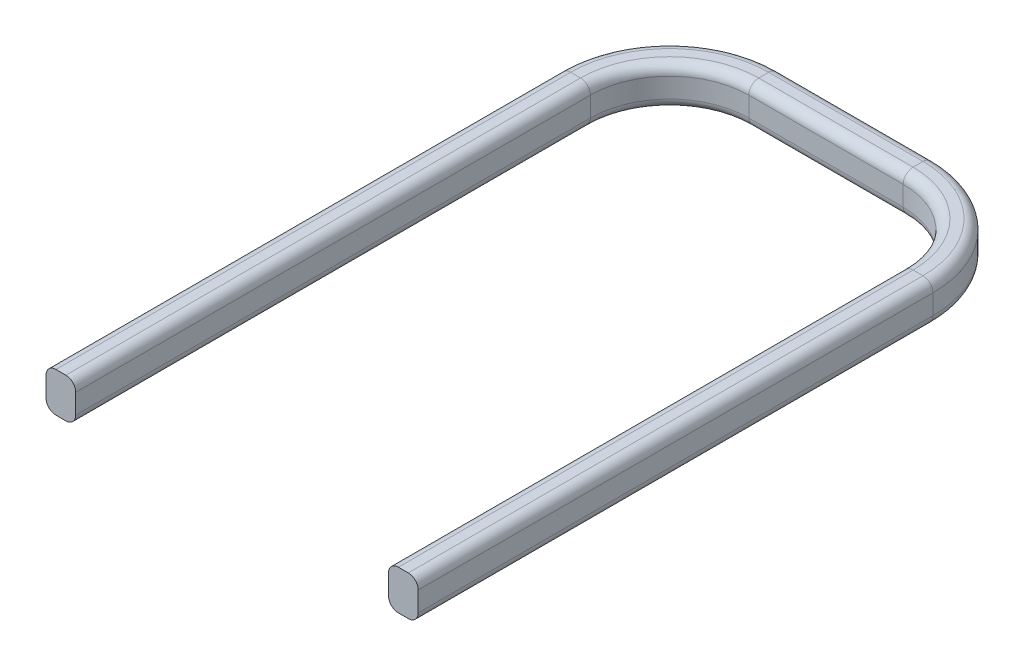
ISO-10303-21;
HEADER;
FILE_DESCRIPTION(('STEP AP214'),'2;1');
FILE_NAME('part.step','',(''),(''),'','','');
FILE_SCHEMA(('AUTOMOTIVE_DESIGN { 1 0 10303 214 1 1 1 1 }'));
ENDSEC;
DATA;
#1=APPLICATION_CONTEXT('core data for automotive mechanical design processes');
#2=APPLICATION_PROTOCOL_DEFINITION('international standard','automotive_design',2000,#1);
#3=PRODUCT_CONTEXT('',#1,'mechanical');
#4=PRODUCT('Part','Part','',(#3));
#5=PRODUCT_RELATED_PRODUCT_CATEGORY('part','',(#4));
#6=PRODUCT_DEFINITION_FORMATION('','',#4);
#7=PRODUCT_DEFINITION_CONTEXT('part definition',#1,'design');
#8=PRODUCT_DEFINITION('design','',#6,#7);
#9=PRODUCT_DEFINITION_SHAPE('','',#8);
#10=(LENGTH_UNIT() NAMED_UNIT(*) SI_UNIT(.MILLI.,.METRE.));
#11=(NAMED_UNIT(*) PLANE_ANGLE_UNIT() SI_UNIT($,.RADIAN.));
#12=(NAMED_UNIT(*) SI_UNIT($,.STERADIAN.) SOLID_ANGLE_UNIT());
#13=UNCERTAINTY_MEASURE_WITH_UNIT(LENGTH_MEASURE(1.E-05),#10,'distance_accuracy_value','');
#14=(GEOMETRIC_REPRESENTATION_CONTEXT(3) GLOBAL_UNCERTAINTY_ASSIGNED_CONTEXT((#13)) GLOBAL_UNIT_ASSIGNED_CONTEXT((#10,
#11,#12)) REPRESENTATION_CONTEXT('',''));
#15=CARTESIAN_POINT('',(0.,0.,0.));
#16=DIRECTION('',(0.,0.,1.));
#17=DIRECTION('',(1.,0.,0.));
#18=AXIS2_PLACEMENT_3D('',#15,#16,#17);
#19=CARTESIAN_POINT('',(0.,-4.5,81.2586733435107));
#20=DIRECTION('',(0.,0.,1.));
#21=DIRECTION('',(1.,0.,0.));
#22=AXIS2_PLACEMENT_3D('',#19,#20,#21);
#23=PLANE('',#22);
#24=DIRECTION('',(0.,-1.,0.));
#25=VECTOR('',#24,1.);
#26=CARTESIAN_POINT('',(-47.,-4.5,81.2586733435107));
#27=LINE('',#26,#25);
#28=CARTESIAN_POINT('',(-47.,3.,81.2586733435107));
#29=VERTEX_POINT('',#28);
#30=CARTESIAN_POINT('',(-47.,-2.,81.2586733435107));
#31=VERTEX_POINT('',#30);
#32=EDGE_CURVE('E391',#29,#31,#27,.T.);
#33=ORIENTED_EDGE('',*,*,#32,.T.);
#34=CARTESIAN_POINT('',(-44.5,-2.,81.2586733435107));
#35=DIRECTION('',(0.,0.,1.));
#36=DIRECTION('',(1.,0.,0.));
#37=AXIS2_PLACEMENT_3D('',#34,#35,#36);
#38=CIRCLE('',#37,2.5);
#39=CARTESIAN_POINT('',(-44.5,-4.5,81.2586733435107));
#40=VERTEX_POINT('',#39);
#41=EDGE_CURVE('E316',#31,#40,#38,.T.);
#42=ORIENTED_EDGE('',*,*,#41,.T.);
#43=DIRECTION('',(1.,0.,0.));
#44=VECTOR('',#43,1.);
#45=CARTESIAN_POINT('',(-39.5,-4.5,81.2586733435107));
#46=LINE('',#45,#44);
#47=CARTESIAN_POINT('',(-42.,-4.5,81.2586733435107));
#48=VERTEX_POINT('',#47);
#49=EDGE_CURVE('E396',#40,#48,#46,.T.);
#50=ORIENTED_EDGE('',*,*,#49,.T.);
#51=CARTESIAN_POINT('',(-42.,-2.,81.2586733435107));
#52=DIRECTION('',(0.,0.,1.));
#53=DIRECTION('',(1.,0.,0.));
#54=AXIS2_PLACEMENT_3D('',#51,#52,#53);
#55=CIRCLE('',#54,2.5);
#56=CARTESIAN_POINT('',(-39.5,-2.,81.2586733435107));
#57=VERTEX_POINT('',#56);
#58=EDGE_CURVE('E314',#48,#57,#55,.T.);
#59=ORIENTED_EDGE('',*,*,#58,.T.);
#60=DIRECTION('',(0.,1.,0.));
#61=VECTOR('',#60,1.);
#62=CARTESIAN_POINT('',(-39.5,-4.5,81.2586733435107));
#63=LINE('',#62,#61);
#64=CARTESIAN_POINT('',(-39.5,3.,81.2586733435107));
#65=VERTEX_POINT('',#64);
#66=EDGE_CURVE('E335',#57,#65,#63,.T.);
#67=ORIENTED_EDGE('',*,*,#66,.T.);
#68=CARTESIAN_POINT('',(-42.,3.,81.2586733435107));
#69=DIRECTION('',(0.,0.,1.));
#70=DIRECTION('',(1.,0.,0.));
#71=AXIS2_PLACEMENT_3D('',#68,#69,#70);
#72=CIRCLE('',#71,2.5);
#73=CARTESIAN_POINT('',(-42.,5.5,81.2586733435107));
#74=VERTEX_POINT('',#73);
#75=EDGE_CURVE('E62',#65,#74,#72,.T.);
#76=ORIENTED_EDGE('',*,*,#75,.T.);
#77=DIRECTION('',(-1.,0.,0.));
#78=VECTOR('',#77,1.);
#79=CARTESIAN_POINT('',(-39.5,5.5,81.2586733435107));
#80=LINE('',#79,#78);
#81=CARTESIAN_POINT('',(-44.5,5.5,81.2586733435107));
#82=VERTEX_POINT('',#81);
#83=EDGE_CURVE('E389',#74,#82,#80,.T.);
#84=ORIENTED_EDGE('',*,*,#83,.T.);
#85=CARTESIAN_POINT('',(-44.5,3.,81.2586733435107));
#86=DIRECTION('',(0.,0.,1.));
#87=DIRECTION('',(1.,0.,0.));
#88=AXIS2_PLACEMENT_3D('',#85,#86,#87);
#89=CIRCLE('',#88,2.5);
#90=EDGE_CURVE('E312',#82,#29,#89,.T.);
#91=ORIENTED_EDGE('',*,*,#90,.T.);
#92=EDGE_LOOP('',(#33,#42,#50,#59,#67,#76,#84,#91));
#93=FACE_BOUND('',#92,.T.);
#94=ADVANCED_FACE('F40',(#93),#23,.T.);
#95=CARTESIAN_POINT('',(0.,-4.5,81.2586733435107));
#96=DIRECTION('',(0.,0.,-1.));
#97=DIRECTION('',(-1.,0.,0.));
#98=AXIS2_PLACEMENT_3D('',#95,#96,#97);
#99=PLANE('',#98);
#100=DIRECTION('',(-1.,0.,0.));
#101=VECTOR('',#100,1.);
#102=CARTESIAN_POINT('',(39.5,-4.5,81.2586733435107));
#103=LINE('',#102,#101);
#104=CARTESIAN_POINT('',(44.5,-4.5,81.2586733435107));
#105=VERTEX_POINT('',#104);
#106=CARTESIAN_POINT('',(42.,-4.5,81.2586733435107));
#107=VERTEX_POINT('',#106);
#108=EDGE_CURVE('E220',#105,#107,#103,.T.);
#109=ORIENTED_EDGE('',*,*,#108,.F.);
#110=CARTESIAN_POINT('',(44.5,-2.,81.2586733435107));
#111=DIRECTION('',(0.,0.,-1.));
#112=DIRECTION('',(-1.,0.,0.));
#113=AXIS2_PLACEMENT_3D('',#110,#111,#112);
#114=CIRCLE('',#113,2.5);
#115=CARTESIAN_POINT('',(47.,-2.,81.2586733435107));
#116=VERTEX_POINT('',#115);
#117=EDGE_CURVE('E203',#105,#116,#114,.F.);
#118=ORIENTED_EDGE('',*,*,#117,.T.);
#119=DIRECTION('',(0.,-1.,0.));
#120=VECTOR('',#119,1.);
#121=CARTESIAN_POINT('',(47.,-4.5,81.2586733435107));
#122=LINE('',#121,#120);
#123=CARTESIAN_POINT('',(47.,3.,81.2586733435107));
#124=VERTEX_POINT('',#123);
#125=EDGE_CURVE('E230',#124,#116,#122,.T.);
#126=ORIENTED_EDGE('',*,*,#125,.F.);
#127=CARTESIAN_POINT('',(44.5,3.,81.2586733435107));
#128=DIRECTION('',(0.,0.,-1.));
#129=DIRECTION('',(-1.,0.,0.));
#130=AXIS2_PLACEMENT_3D('',#127,#128,#129);
#131=CIRCLE('',#130,2.5);
#132=CARTESIAN_POINT('',(44.5,5.5,81.2586733435107));
#133=VERTEX_POINT('',#132);
#134=EDGE_CURVE('E239',#124,#133,#131,.F.);
#135=ORIENTED_EDGE('',*,*,#134,.T.);
#136=DIRECTION('',(1.,0.,0.));
#137=VECTOR('',#136,1.);
#138=CARTESIAN_POINT('',(39.5,5.5,81.2586733435107));
#139=LINE('',#138,#137);
#140=CARTESIAN_POINT('',(42.,5.5,81.2586733435107));
#141=VERTEX_POINT('',#140);
#142=EDGE_CURVE('E233',#141,#133,#139,.T.);
#143=ORIENTED_EDGE('',*,*,#142,.F.);
#144=CARTESIAN_POINT('',(42.,3.,81.2586733435107));
#145=DIRECTION('',(0.,0.,-1.));
#146=DIRECTION('',(-1.,0.,0.));
#147=AXIS2_PLACEMENT_3D('',#144,#145,#146);
#148=CIRCLE('',#147,2.5);
#149=CARTESIAN_POINT('',(39.5,3.,81.2586733435107));
#150=VERTEX_POINT('',#149);
#151=EDGE_CURVE('E225',#141,#150,#148,.F.);
#152=ORIENTED_EDGE('',*,*,#151,.T.);
#153=DIRECTION('',(0.,1.,0.));
#154=VECTOR('',#153,1.);
#155=CARTESIAN_POINT('',(39.5,-4.5,81.2586733435107));
#156=LINE('',#155,#154);
#157=CARTESIAN_POINT('',(39.5,-2.,81.2586733435107));
#158=VERTEX_POINT('',#157);
#159=EDGE_CURVE('E412',#158,#150,#156,.T.);
#160=ORIENTED_EDGE('',*,*,#159,.F.);
#161=CARTESIAN_POINT('',(42.,-2.,81.2586733435107));
#162=DIRECTION('',(0.,0.,-1.));
#163=DIRECTION('',(-1.,0.,0.));
#164=AXIS2_PLACEMENT_3D('',#161,#162,#163);
#165=CIRCLE('',#164,2.5);
#166=EDGE_CURVE('E214',#158,#107,#165,.F.);
#167=ORIENTED_EDGE('',*,*,#166,.T.);
#168=EDGE_LOOP('',(#109,#118,#126,#135,#143,#152,#160,#167));
#169=FACE_BOUND('',#168,.T.);
#170=ADVANCED_FACE('F228',(#169),#99,.F.);
#171=CARTESIAN_POINT('',(-39.5,-4.5,81.2586733435107));
#172=DIRECTION('',(-1.,0.,0.));
#173=DIRECTION('',(0.,0.,1.));
#174=AXIS2_PLACEMENT_3D('',#171,#172,#173);
#175=PLANE('',#174);
#176=ORIENTED_EDGE('',*,*,#66,.F.);
#177=DIRECTION('',(0.,0.,-1.));
#178=VECTOR('',#177,1.);
#179=CARTESIAN_POINT('',(-39.5,-2.,81.2586733435107));
#180=LINE('',#179,#178);
#181=CARTESIAN_POINT('',(-39.5,-2.,-48.7413266564892));
#182=VERTEX_POINT('',#181);
#183=EDGE_CURVE('E320',#57,#182,#180,.T.);
#184=ORIENTED_EDGE('',*,*,#183,.T.);
#185=DIRECTION('',(0.,1.,0.));
#186=VECTOR('',#185,1.);
#187=CARTESIAN_POINT('',(-39.5,-4.5,-48.7413266564892));
#188=LINE('',#187,#186);
#189=CARTESIAN_POINT('',(-39.5,3.,-48.7413266564892));
#190=VERTEX_POINT('',#189);
#191=EDGE_CURVE('E385',#182,#190,#188,.T.);
#192=ORIENTED_EDGE('',*,*,#191,.T.);
#193=DIRECTION('',(0.,0.,-1.));
#194=VECTOR('',#193,1.);
#195=CARTESIAN_POINT('',(-39.5,3.,81.2586733435107));
#196=LINE('',#195,#194);
#197=EDGE_CURVE('E318',#190,#65,#196,.F.);
#198=ORIENTED_EDGE('',*,*,#197,.T.);
#199=EDGE_LOOP('',(#176,#184,#192,#198));
#200=FACE_BOUND('',#199,.T.);
#201=ADVANCED_FACE('F382',(#200),#175,.F.);
#202=CARTESIAN_POINT('',(-39.5,5.5,81.2586733435107));
#203=DIRECTION('',(0.,-1.,0.));
#204=DIRECTION('',(0.,0.,-1.));
#205=AXIS2_PLACEMENT_3D('',#202,#203,#204);
#206=PLANE('',#205);
#207=DIRECTION('',(-1.,0.,0.));
#208=VECTOR('',#207,1.);
#209=CARTESIAN_POINT('',(-39.5,5.5,-48.7413266564892));
#210=LINE('',#209,#208);
#211=CARTESIAN_POINT('',(-42.,5.5,-48.7413266564892));
#212=VERTEX_POINT('',#211);
#213=CARTESIAN_POINT('',(-44.5,5.5,-48.7413266564892));
#214=VERTEX_POINT('',#213);
#215=EDGE_CURVE('E395',#212,#214,#210,.T.);
#216=ORIENTED_EDGE('',*,*,#215,.T.);
#217=DIRECTION('',(0.,0.,-1.));
#218=VECTOR('',#217,1.);
#219=CARTESIAN_POINT('',(-44.5,5.5,81.2586733435107));
#220=LINE('',#219,#218);
#221=EDGE_CURVE('E11',#214,#82,#220,.F.);
#222=ORIENTED_EDGE('',*,*,#221,.T.);
#223=ORIENTED_EDGE('',*,*,#83,.F.);
#224=DIRECTION('',(0.,0.,-1.));
#225=VECTOR('',#224,1.);
#226=CARTESIAN_POINT('',(-42.,5.5,81.2586733435107));
#227=LINE('',#226,#225);
#228=EDGE_CURVE('E49',#74,#212,#227,.T.);
#229=ORIENTED_EDGE('',*,*,#228,.T.);
#230=EDGE_LOOP('',(#216,#222,#223,#229));
#231=FACE_BOUND('',#230,.T.);
#232=ADVANCED_FACE('F811',(#231),#206,.F.);
#233=CARTESIAN_POINT('',(-47.,-4.5,81.2586733435107));
#234=DIRECTION('',(1.,0.,0.));
#235=DIRECTION('',(0.,0.,-1.));
#236=AXIS2_PLACEMENT_3D('',#233,#234,#235);
#237=PLANE('',#236);
#238=DIRECTION('',(0.,-1.,0.));
#239=VECTOR('',#238,1.);
#240=CARTESIAN_POINT('',(-47.,-4.5,-48.7413266564892));
#241=LINE('',#240,#239);
#242=CARTESIAN_POINT('',(-47.,3.,-48.7413266564892));
#243=VERTEX_POINT('',#242);
#244=CARTESIAN_POINT('',(-47.,-2.,-48.7413266564892));
#245=VERTEX_POINT('',#244);
#246=EDGE_CURVE('E416',#243,#245,#241,.T.);
#247=ORIENTED_EDGE('',*,*,#246,.T.);
#248=DIRECTION('',(0.,0.,-1.));
#249=VECTOR('',#248,1.);
#250=CARTESIAN_POINT('',(-47.,-2.,81.2586733435107));
#251=LINE('',#250,#249);
#252=EDGE_CURVE('E309',#245,#31,#251,.F.);
#253=ORIENTED_EDGE('',*,*,#252,.T.);
#254=ORIENTED_EDGE('',*,*,#32,.F.);
#255=DIRECTION('',(0.,0.,-1.));
#256=VECTOR('',#255,1.);
#257=CARTESIAN_POINT('',(-47.,3.,81.2586733435107));
#258=LINE('',#257,#256);
#259=EDGE_CURVE('E307',#29,#243,#258,.T.);
#260=ORIENTED_EDGE('',*,*,#259,.T.);
#261=EDGE_LOOP('',(#247,#253,#254,#260));
#262=FACE_BOUND('',#261,.T.);
#263=ADVANCED_FACE('F800',(#262),#237,.F.);
#264=CARTESIAN_POINT('',(-39.5,-4.5,81.2586733435107));
#265=DIRECTION('',(0.,1.,0.));
#266=DIRECTION('',(-1.,0.,0.));
#267=AXIS2_PLACEMENT_3D('',#264,#265,#266);
#268=PLANE('',#267);
#269=ORIENTED_EDGE('',*,*,#49,.F.);
#270=DIRECTION('',(0.,0.,-1.));
#271=VECTOR('',#270,1.);
#272=CARTESIAN_POINT('',(-44.5,-4.5,81.2586733435107));
#273=LINE('',#272,#271);
#274=CARTESIAN_POINT('',(-44.5,-4.5,-48.7413266564892));
#275=VERTEX_POINT('',#274);
#276=EDGE_CURVE('E305',#40,#275,#273,.T.);
#277=ORIENTED_EDGE('',*,*,#276,.T.);
#278=DIRECTION('',(1.,0.,0.));
#279=VECTOR('',#278,1.);
#280=CARTESIAN_POINT('',(-39.5,-4.5,-48.7413266564892));
#281=LINE('',#280,#279);
#282=CARTESIAN_POINT('',(-42.,-4.5,-48.7413266564892));
#283=VERTEX_POINT('',#282);
#284=EDGE_CURVE('E401',#275,#283,#281,.T.);
#285=ORIENTED_EDGE('',*,*,#284,.T.);
#286=DIRECTION('',(0.,0.,-1.));
#287=VECTOR('',#286,1.);
#288=CARTESIAN_POINT('',(-42.,-4.5,81.2586733435107));
#289=LINE('',#288,#287);
#290=EDGE_CURVE('E303',#283,#48,#289,.F.);
#291=ORIENTED_EDGE('',*,*,#290,.T.);
#292=EDGE_LOOP('',(#269,#277,#285,#291));
#293=FACE_BOUND('',#292,.T.);
#294=ADVANCED_FACE('F789',(#293),#268,.F.);
#295=CARTESIAN_POINT('',(-19.5,-4.5,-48.7413266564893));
#296=DIRECTION('',(0.,-1.,0.));
#297=DIRECTION('',(0.,0.,-1.));
#298=AXIS2_PLACEMENT_3D('',#295,#296,#297);
#299=CYLINDRICAL_SURFACE('',#298,20.);
#300=ORIENTED_EDGE('',*,*,#191,.F.);
#301=CARTESIAN_POINT('',(-19.5,-2.,-48.7413266564893));
#302=DIRECTION('',(0.,1.,0.));
#303=DIRECTION('',(0.,0.,1.));
#304=AXIS2_PLACEMENT_3D('',#301,#302,#303);
#305=CIRCLE('',#304,20.);
#306=CARTESIAN_POINT('',(-19.5,-2.,-68.7413266564893));
#307=VERTEX_POINT('',#306);
#308=EDGE_CURVE('E284',#182,#307,#305,.F.);
#309=ORIENTED_EDGE('',*,*,#308,.T.);
#310=DIRECTION('',(0.,1.,0.));
#311=VECTOR('',#310,1.);
#312=CARTESIAN_POINT('',(-19.5,-4.5,-68.7413266564893));
#313=LINE('',#312,#311);
#314=CARTESIAN_POINT('',(-19.5,3.,-68.7413266564893));
#315=VERTEX_POINT('',#314);
#316=EDGE_CURVE('E397',#307,#315,#313,.T.);
#317=ORIENTED_EDGE('',*,*,#316,.T.);
#318=CARTESIAN_POINT('',(-19.5,3.,-48.7413266564893));
#319=DIRECTION('',(0.,-1.,0.));
#320=DIRECTION('',(0.,0.,-1.));
#321=AXIS2_PLACEMENT_3D('',#318,#319,#320);
#322=CIRCLE('',#321,20.);
#323=EDGE_CURVE('E282',#315,#190,#322,.F.);
#324=ORIENTED_EDGE('',*,*,#323,.T.);
#325=EDGE_LOOP('',(#300,#309,#317,#324));
#326=FACE_BOUND('',#325,.T.);
#327=ADVANCED_FACE('F778',(#326),#299,.F.);
#328=CARTESIAN_POINT('',(-39.5,5.5,-48.7413266564895));
#329=DIRECTION('',(0.,-1.,0.));
#330=DIRECTION('',(0.,0.,-1.));
#331=AXIS2_PLACEMENT_3D('',#328,#329,#330);
#332=PLANE('',#331);
#333=DIRECTION('',(0.,0.,-1.));
#334=VECTOR('',#333,1.);
#335=CARTESIAN_POINT('',(-19.5,5.5,-68.7413266564893));
#336=LINE('',#335,#334);
#337=CARTESIAN_POINT('',(-19.5,5.5,-71.2413266564893));
#338=VERTEX_POINT('',#337);
#339=CARTESIAN_POINT('',(-19.5,5.5,-73.7413266564893));
#340=VERTEX_POINT('',#339);
#341=EDGE_CURVE('E400',#338,#340,#336,.T.);
#342=ORIENTED_EDGE('',*,*,#341,.T.);
#343=CARTESIAN_POINT('',(-19.5,5.5,-48.7413266564893));
#344=DIRECTION('',(0.,-1.,0.));
#345=DIRECTION('',(0.,0.,-1.));
#346=AXIS2_PLACEMENT_3D('',#343,#344,#345);
#347=CIRCLE('',#346,25.);
#348=EDGE_CURVE('E301',#340,#214,#347,.F.);
#349=ORIENTED_EDGE('',*,*,#348,.T.);
#350=ORIENTED_EDGE('',*,*,#215,.F.);
#351=CARTESIAN_POINT('',(-19.5,5.5,-48.7413266564893));
#352=DIRECTION('',(0.,-1.,0.));
#353=DIRECTION('',(0.,0.,-1.));
#354=AXIS2_PLACEMENT_3D('',#351,#352,#353);
#355=CIRCLE('',#354,22.5);
#356=EDGE_CURVE('E299',#212,#338,#355,.T.);
#357=ORIENTED_EDGE('',*,*,#356,.T.);
#358=EDGE_LOOP('',(#342,#349,#350,#357));
#359=FACE_BOUND('',#358,.T.);
#360=ADVANCED_FACE('F767',(#359),#332,.F.);
#361=CARTESIAN_POINT('',(-19.5,-4.5,-48.7413266564893));
#362=DIRECTION('',(0.,-1.,0.));
#363=DIRECTION('',(0.,0.,-1.));
#364=AXIS2_PLACEMENT_3D('',#361,#362,#363);
#365=CYLINDRICAL_SURFACE('',#364,27.5);
#366=DIRECTION('',(0.,-1.,0.));
#367=VECTOR('',#366,1.);
#368=CARTESIAN_POINT('',(-19.5,-4.5,-76.2413266564893));
#369=LINE('',#368,#367);
#370=CARTESIAN_POINT('',(-19.5,3.,-76.2413266564893));
#371=VERTEX_POINT('',#370);
#372=CARTESIAN_POINT('',(-19.5,-2.,-76.2413266564893));
#373=VERTEX_POINT('',#372);
#374=EDGE_CURVE('E419',#371,#373,#369,.T.);
#375=ORIENTED_EDGE('',*,*,#374,.T.);
#376=CARTESIAN_POINT('',(-19.5,-2.,-48.7413266564893));
#377=DIRECTION('',(0.,1.,0.));
#378=DIRECTION('',(0.,0.,1.));
#379=AXIS2_PLACEMENT_3D('',#376,#377,#378);
#380=CIRCLE('',#379,27.5);
#381=EDGE_CURVE('E267',#373,#245,#380,.T.);
#382=ORIENTED_EDGE('',*,*,#381,.T.);
#383=ORIENTED_EDGE('',*,*,#246,.F.);
#384=CARTESIAN_POINT('',(-19.5,3.,-48.7413266564893));
#385=DIRECTION('',(0.,-1.,0.));
#386=DIRECTION('',(0.,0.,-1.));
#387=AXIS2_PLACEMENT_3D('',#384,#385,#386);
#388=CIRCLE('',#387,27.5);
#389=EDGE_CURVE('E265',#243,#371,#388,.T.);
#390=ORIENTED_EDGE('',*,*,#389,.T.);
#391=EDGE_LOOP('',(#375,#382,#383,#390));
#392=FACE_BOUND('',#391,.T.);
#393=ADVANCED_FACE('F756',(#392),#365,.T.);
#394=CARTESIAN_POINT('',(-39.5,-4.5,-48.7413266564895));
#395=DIRECTION('',(0.,1.,0.));
#396=DIRECTION('',(0.,0.,1.));
#397=AXIS2_PLACEMENT_3D('',#394,#395,#396);
#398=PLANE('',#397);
#399=ORIENTED_EDGE('',*,*,#284,.F.);
#400=CARTESIAN_POINT('',(-19.5,-4.5,-48.7413266564893));
#401=DIRECTION('',(0.,1.,0.));
#402=DIRECTION('',(0.,0.,1.));
#403=AXIS2_PLACEMENT_3D('',#400,#401,#402);
#404=CIRCLE('',#403,25.);
#405=CARTESIAN_POINT('',(-19.5,-4.5,-73.7413266564893));
#406=VERTEX_POINT('',#405);
#407=EDGE_CURVE('E263',#275,#406,#404,.F.);
#408=ORIENTED_EDGE('',*,*,#407,.T.);
#409=DIRECTION('',(0.,0.,1.));
#410=VECTOR('',#409,1.);
#411=CARTESIAN_POINT('',(-19.5,-4.5,-68.7413266564893));
#412=LINE('',#411,#410);
#413=CARTESIAN_POINT('',(-19.5,-4.5,-71.2413266564893));
#414=VERTEX_POINT('',#413);
#415=EDGE_CURVE('E406',#406,#414,#412,.T.);
#416=ORIENTED_EDGE('',*,*,#415,.T.);
#417=CARTESIAN_POINT('',(-19.5,-4.5,-48.7413266564893));
#418=DIRECTION('',(0.,1.,0.));
#419=DIRECTION('',(0.,0.,1.));
#420=AXIS2_PLACEMENT_3D('',#417,#418,#419);
#421=CIRCLE('',#420,22.5);
#422=EDGE_CURVE('E261',#414,#283,#421,.T.);
#423=ORIENTED_EDGE('',*,*,#422,.T.);
#424=EDGE_LOOP('',(#399,#408,#416,#423));
#425=FACE_BOUND('',#424,.T.);
#426=ADVANCED_FACE('F746',(#425),#398,.F.);
#427=CARTESIAN_POINT('',(-19.5,-4.5,-68.7413266564893));
#428=DIRECTION('',(0.,0.,-1.));
#429=DIRECTION('',(-1.,0.,0.));
#430=AXIS2_PLACEMENT_3D('',#427,#428,#429);
#431=PLANE('',#430);
#432=ORIENTED_EDGE('',*,*,#316,.F.);
#433=DIRECTION('',(1.,0.,0.));
#434=VECTOR('',#433,1.);
#435=CARTESIAN_POINT('',(-19.5,-2.,-68.7413266564893));
#436=LINE('',#435,#434);
#437=CARTESIAN_POINT('',(19.4999999999999,-2.,-68.7413266564893));
#438=VERTEX_POINT('',#437);
#439=EDGE_CURVE('E280',#307,#438,#436,.T.);
#440=ORIENTED_EDGE('',*,*,#439,.T.);
#441=DIRECTION('',(0.,1.,0.));
#442=VECTOR('',#441,1.);
#443=CARTESIAN_POINT('',(19.4999999999999,-4.5,-68.7413266564893));
#444=LINE('',#443,#442);
#445=CARTESIAN_POINT('',(19.4999999999999,3.,-68.7413266564893));
#446=VERTEX_POINT('',#445);
#447=EDGE_CURVE('E402',#438,#446,#444,.T.);
#448=ORIENTED_EDGE('',*,*,#447,.T.);
#449=DIRECTION('',(1.,0.,0.));
#450=VECTOR('',#449,1.);
#451=CARTESIAN_POINT('',(-19.5,3.,-68.7413266564893));
#452=LINE('',#451,#450);
#453=EDGE_CURVE('E278',#446,#315,#452,.F.);
#454=ORIENTED_EDGE('',*,*,#453,.T.);
#455=EDGE_LOOP('',(#432,#440,#448,#454));
#456=FACE_BOUND('',#455,.T.);
#457=ADVANCED_FACE('F479',(#456),#431,.F.);
#458=CARTESIAN_POINT('',(-19.5,5.5,-68.7413266564893));
#459=DIRECTION('',(0.,-1.,0.));
#460=DIRECTION('',(0.,0.,-1.));
#461=AXIS2_PLACEMENT_3D('',#458,#459,#460);
#462=PLANE('',#461);
#463=DIRECTION('',(0.,0.,-1.));
#464=VECTOR('',#463,1.);
#465=CARTESIAN_POINT('',(19.4999999999999,5.5,-68.7413266564893));
#466=LINE('',#465,#464);
#467=CARTESIAN_POINT('',(19.4999999999999,5.5,-71.2413266564893));
#468=VERTEX_POINT('',#467);
#469=CARTESIAN_POINT('',(19.4999999999999,5.5,-73.7413266564893));
#470=VERTEX_POINT('',#469);
#471=EDGE_CURVE('E405',#468,#470,#466,.T.);
#472=ORIENTED_EDGE('',*,*,#471,.T.);
#473=DIRECTION('',(1.,0.,0.));
#474=VECTOR('',#473,1.);
#475=CARTESIAN_POINT('',(-19.5,5.5,-73.7413266564893));
#476=LINE('',#475,#474);
#477=EDGE_CURVE('E297',#470,#340,#476,.F.);
#478=ORIENTED_EDGE('',*,*,#477,.T.);
#479=ORIENTED_EDGE('',*,*,#341,.F.);
#480=DIRECTION('',(1.,0.,0.));
#481=VECTOR('',#480,1.);
#482=CARTESIAN_POINT('',(-19.5,5.5,-71.2413266564893));
#483=LINE('',#482,#481);
#484=EDGE_CURVE('E295',#338,#468,#483,.T.);
#485=ORIENTED_EDGE('',*,*,#484,.T.);
#486=EDGE_LOOP('',(#472,#478,#479,#485));
#487=FACE_BOUND('',#486,.T.);
#488=ADVANCED_FACE('F484',(#487),#462,.F.);
#489=CARTESIAN_POINT('',(-19.5,-4.5,-76.2413266564893));
#490=DIRECTION('',(0.,0.,1.));
#491=DIRECTION('',(1.,0.,0.));
#492=AXIS2_PLACEMENT_3D('',#489,#490,#491);
#493=PLANE('',#492);
#494=DIRECTION('',(0.,-1.,0.));
#495=VECTOR('',#494,1.);
#496=CARTESIAN_POINT('',(19.4999999999999,-4.5,-76.2413266564893));
#497=LINE('',#496,#495);
#498=CARTESIAN_POINT('',(19.4999999999999,3.,-76.2413266564893));
#499=VERTEX_POINT('',#498);
#500=CARTESIAN_POINT('',(19.4999999999999,-2.,-76.2413266564893));
#501=VERTEX_POINT('',#500);
#502=EDGE_CURVE('E422',#499,#501,#497,.T.);
#503=ORIENTED_EDGE('',*,*,#502,.T.);
#504=DIRECTION('',(1.,0.,0.));
#505=VECTOR('',#504,1.);
#506=CARTESIAN_POINT('',(-19.5,-2.,-76.2413266564893));
#507=LINE('',#506,#505);
#508=EDGE_CURVE('E259',#501,#373,#507,.F.);
#509=ORIENTED_EDGE('',*,*,#508,.T.);
#510=ORIENTED_EDGE('',*,*,#374,.F.);
#511=DIRECTION('',(1.,0.,0.));
#512=VECTOR('',#511,1.);
#513=CARTESIAN_POINT('',(-19.5,3.,-76.2413266564893));
#514=LINE('',#513,#512);
#515=EDGE_CURVE('E257',#371,#499,#514,.T.);
#516=ORIENTED_EDGE('',*,*,#515,.T.);
#517=EDGE_LOOP('',(#503,#509,#510,#516));
#518=FACE_BOUND('',#517,.T.);
#519=ADVANCED_FACE('F718',(#518),#493,.F.);
#520=CARTESIAN_POINT('',(-19.5,-4.5,-68.7413266564893));
#521=DIRECTION('',(0.,1.,0.));
#522=DIRECTION('',(0.,0.,1.));
#523=AXIS2_PLACEMENT_3D('',#520,#521,#522);
#524=PLANE('',#523);
#525=ORIENTED_EDGE('',*,*,#415,.F.);
#526=DIRECTION('',(1.,0.,0.));
#527=VECTOR('',#526,1.);
#528=CARTESIAN_POINT('',(-19.5,-4.5,-73.7413266564893));
#529=LINE('',#528,#527);
#530=CARTESIAN_POINT('',(19.4999999999999,-4.5,-73.7413266564893));
#531=VERTEX_POINT('',#530);
#532=EDGE_CURVE('E255',#406,#531,#529,.T.);
#533=ORIENTED_EDGE('',*,*,#532,.T.);
#534=DIRECTION('',(0.,0.,1.));
#535=VECTOR('',#534,1.);
#536=CARTESIAN_POINT('',(19.4999999999999,-4.5,-68.7413266564893));
#537=LINE('',#536,#535);
#538=CARTESIAN_POINT('',(19.4999999999999,-4.5,-71.2413266564893));
#539=VERTEX_POINT('',#538);
#540=EDGE_CURVE('E411',#531,#539,#537,.T.);
#541=ORIENTED_EDGE('',*,*,#540,.T.);
#542=DIRECTION('',(1.,0.,0.));
#543=VECTOR('',#542,1.);
#544=CARTESIAN_POINT('',(-19.5,-4.5,-71.2413266564893));
#545=LINE('',#544,#543);
#546=EDGE_CURVE('E253',#539,#414,#545,.F.);
#547=ORIENTED_EDGE('',*,*,#546,.T.);
#548=EDGE_LOOP('',(#525,#533,#541,#547));
#549=FACE_BOUND('',#548,.T.);
#550=ADVANCED_FACE('F446',(#549),#524,.F.);
#551=CARTESIAN_POINT('',(19.5,-4.5,-48.7413266564893));
#552=DIRECTION('',(0.,-1.,0.));
#553=DIRECTION('',(0.,0.,-1.));
#554=AXIS2_PLACEMENT_3D('',#551,#552,#553);
#555=CYLINDRICAL_SURFACE('',#554,20.);
#556=ORIENTED_EDGE('',*,*,#447,.F.);
#557=CARTESIAN_POINT('',(19.5,-2.,-48.7413266564893));
#558=DIRECTION('',(0.,1.,0.));
#559=DIRECTION('',(0.,0.,1.));
#560=AXIS2_PLACEMENT_3D('',#557,#558,#559);
#561=CIRCLE('',#560,20.);
#562=CARTESIAN_POINT('',(39.5,-2.,-48.7413266564892));
#563=VERTEX_POINT('',#562);
#564=EDGE_CURVE('E276',#438,#563,#561,.F.);
#565=ORIENTED_EDGE('',*,*,#564,.T.);
#566=DIRECTION('',(0.,1.,0.));
#567=VECTOR('',#566,1.);
#568=CARTESIAN_POINT('',(39.5,-4.5,-48.7413266564892));
#569=LINE('',#568,#567);
#570=CARTESIAN_POINT('',(39.5,3.,-48.7413266564892));
#571=VERTEX_POINT('',#570);
#572=EDGE_CURVE('E407',#563,#571,#569,.T.);
#573=ORIENTED_EDGE('',*,*,#572,.T.);
#574=CARTESIAN_POINT('',(19.5,3.,-48.7413266564893));
#575=DIRECTION('',(0.,-1.,0.));
#576=DIRECTION('',(0.,0.,-1.));
#577=AXIS2_PLACEMENT_3D('',#574,#575,#576);
#578=CIRCLE('',#577,20.);
#579=EDGE_CURVE('E274',#571,#446,#578,.F.);
#580=ORIENTED_EDGE('',*,*,#579,.T.);
#581=EDGE_LOOP('',(#556,#565,#573,#580));
#582=FACE_BOUND('',#581,.T.);
#583=ADVANCED_FACE('F464',(#582),#555,.F.);
#584=CARTESIAN_POINT('',(19.4999999999999,5.5,-68.7413266564893));
#585=DIRECTION('',(0.,-1.,0.));
#586=DIRECTION('',(0.,0.,-1.));
#587=AXIS2_PLACEMENT_3D('',#584,#585,#586);
#588=PLANE('',#587);
#589=DIRECTION('',(1.,0.,0.));
#590=VECTOR('',#589,1.);
#591=CARTESIAN_POINT('',(39.5,5.5,-48.7413266564892));
#592=LINE('',#591,#590);
#593=CARTESIAN_POINT('',(42.,5.5,-48.7413266564892));
#594=VERTEX_POINT('',#593);
#595=CARTESIAN_POINT('',(44.5,5.5,-48.7413266564892));
#596=VERTEX_POINT('',#595);
#597=EDGE_CURVE('E410',#594,#596,#592,.T.);
#598=ORIENTED_EDGE('',*,*,#597,.T.);
#599=CARTESIAN_POINT('',(19.5,5.5,-48.7413266564893));
#600=DIRECTION('',(0.,-1.,0.));
#601=DIRECTION('',(0.,0.,-1.));
#602=AXIS2_PLACEMENT_3D('',#599,#600,#601);
#603=CIRCLE('',#602,25.);
#604=EDGE_CURVE('E293',#596,#470,#603,.F.);
#605=ORIENTED_EDGE('',*,*,#604,.T.);
#606=ORIENTED_EDGE('',*,*,#471,.F.);
#607=CARTESIAN_POINT('',(19.5,5.5,-48.7413266564893));
#608=DIRECTION('',(0.,-1.,0.));
#609=DIRECTION('',(0.,0.,-1.));
#610=AXIS2_PLACEMENT_3D('',#607,#608,#609);
#611=CIRCLE('',#610,22.5);
#612=EDGE_CURVE('E291',#468,#594,#611,.T.);
#613=ORIENTED_EDGE('',*,*,#612,.T.);
#614=EDGE_LOOP('',(#598,#605,#606,#613));
#615=FACE_BOUND('',#614,.T.);
#616=ADVANCED_FACE('F487',(#615),#588,.F.);
#617=CARTESIAN_POINT('',(19.5,-4.5,-48.7413266564893));
#618=DIRECTION('',(0.,-1.,0.));
#619=DIRECTION('',(0.,0.,-1.));
#620=AXIS2_PLACEMENT_3D('',#617,#618,#619);
#621=CYLINDRICAL_SURFACE('',#620,27.5);
#622=DIRECTION('',(0.,-1.,0.));
#623=VECTOR('',#622,1.);
#624=CARTESIAN_POINT('',(47.,-4.5,-48.7413266564891));
#625=LINE('',#624,#623);
#626=CARTESIAN_POINT('',(47.,3.,-48.7413266564891));
#627=VERTEX_POINT('',#626);
#628=CARTESIAN_POINT('',(47.,-2.,-48.7413266564891));
#629=VERTEX_POINT('',#628);
#630=EDGE_CURVE('E425',#627,#629,#625,.T.);
#631=ORIENTED_EDGE('',*,*,#630,.T.);
#632=CARTESIAN_POINT('',(19.5,-2.,-48.7413266564893));
#633=DIRECTION('',(0.,1.,0.));
#634=DIRECTION('',(0.,0.,1.));
#635=AXIS2_PLACEMENT_3D('',#632,#633,#634);
#636=CIRCLE('',#635,27.5);
#637=EDGE_CURVE('E251',#629,#501,#636,.T.);
#638=ORIENTED_EDGE('',*,*,#637,.T.);
#639=ORIENTED_EDGE('',*,*,#502,.F.);
#640=CARTESIAN_POINT('',(19.5,3.,-48.7413266564893));
#641=DIRECTION('',(0.,-1.,0.));
#642=DIRECTION('',(0.,0.,-1.));
#643=AXIS2_PLACEMENT_3D('',#640,#641,#642);
#644=CIRCLE('',#643,27.5);
#645=EDGE_CURVE('E249',#499,#627,#644,.T.);
#646=ORIENTED_EDGE('',*,*,#645,.T.);
#647=EDGE_LOOP('',(#631,#638,#639,#646));
#648=FACE_BOUND('',#647,.T.);
#649=ADVANCED_FACE('F682',(#648),#621,.T.);
#650=CARTESIAN_POINT('',(19.4999999999999,-4.5,-68.7413266564893));
#651=DIRECTION('',(0.,1.,0.));
#652=DIRECTION('',(0.,0.,1.));
#653=AXIS2_PLACEMENT_3D('',#650,#651,#652);
#654=PLANE('',#653);
#655=ORIENTED_EDGE('',*,*,#540,.F.);
#656=CARTESIAN_POINT('',(19.5,-4.5,-48.7413266564893));
#657=DIRECTION('',(0.,1.,0.));
#658=DIRECTION('',(0.,0.,1.));
#659=AXIS2_PLACEMENT_3D('',#656,#657,#658);
#660=CIRCLE('',#659,25.);
#661=CARTESIAN_POINT('',(44.5,-4.5,-48.7413266564892));
#662=VERTEX_POINT('',#661);
#663=EDGE_CURVE('E247',#531,#662,#660,.F.);
#664=ORIENTED_EDGE('',*,*,#663,.T.);
#665=DIRECTION('',(-1.,0.,0.));
#666=VECTOR('',#665,1.);
#667=CARTESIAN_POINT('',(39.5,-4.5,-48.7413266564892));
#668=LINE('',#667,#666);
#669=CARTESIAN_POINT('',(42.,-4.5,-48.7413266564892));
#670=VERTEX_POINT('',#669);
#671=EDGE_CURVE('E223',#662,#670,#668,.T.);
#672=ORIENTED_EDGE('',*,*,#671,.T.);
#673=CARTESIAN_POINT('',(19.5,-4.5,-48.7413266564893));
#674=DIRECTION('',(0.,1.,0.));
#675=DIRECTION('',(0.,0.,1.));
#676=AXIS2_PLACEMENT_3D('',#673,#674,#675);
#677=CIRCLE('',#676,22.5);
#678=EDGE_CURVE('E245',#670,#539,#677,.T.);
#679=ORIENTED_EDGE('',*,*,#678,.T.);
#680=EDGE_LOOP('',(#655,#664,#672,#679));
#681=FACE_BOUND('',#680,.T.);
#682=ADVANCED_FACE('F512',(#681),#654,.F.);
#683=CARTESIAN_POINT('',(39.5,-4.5,-48.7413266564892));
#684=DIRECTION('',(1.,0.,0.));
#685=DIRECTION('',(0.,0.,-1.));
#686=AXIS2_PLACEMENT_3D('',#683,#684,#685);
#687=PLANE('',#686);
#688=ORIENTED_EDGE('',*,*,#572,.F.);
#689=DIRECTION('',(0.,0.,1.));
#690=VECTOR('',#689,1.);
#691=CARTESIAN_POINT('',(39.5,-2.,-48.7413266564892));
#692=LINE('',#691,#690);
#693=EDGE_CURVE('E271',#563,#158,#692,.T.);
#694=ORIENTED_EDGE('',*,*,#693,.T.);
#695=ORIENTED_EDGE('',*,*,#159,.T.);
#696=DIRECTION('',(0.,0.,1.));
#697=VECTOR('',#696,1.);
#698=CARTESIAN_POINT('',(39.5,3.,-48.7413266564892));
#699=LINE('',#698,#697);
#700=EDGE_CURVE('E269',#150,#571,#699,.F.);
#701=ORIENTED_EDGE('',*,*,#700,.T.);
#702=EDGE_LOOP('',(#688,#694,#695,#701));
#703=FACE_BOUND('',#702,.T.);
#704=ADVANCED_FACE('F467',(#703),#687,.F.);
#705=CARTESIAN_POINT('',(39.5,5.5,-48.7413266564892));
#706=DIRECTION('',(0.,-1.,0.));
#707=DIRECTION('',(0.,0.,-1.));
#708=AXIS2_PLACEMENT_3D('',#705,#706,#707);
#709=PLANE('',#708);
#710=ORIENTED_EDGE('',*,*,#142,.T.);
#711=DIRECTION('',(0.,0.,1.));
#712=VECTOR('',#711,1.);
#713=CARTESIAN_POINT('',(44.5,5.5,-48.7413266564892));
#714=LINE('',#713,#712);
#715=EDGE_CURVE('E289',#133,#596,#714,.F.);
#716=ORIENTED_EDGE('',*,*,#715,.T.);
#717=ORIENTED_EDGE('',*,*,#597,.F.);
#718=DIRECTION('',(0.,0.,1.));
#719=VECTOR('',#718,1.);
#720=CARTESIAN_POINT('',(42.,5.5,-48.7413266564892));
#721=LINE('',#720,#719);
#722=EDGE_CURVE('E286',#594,#141,#721,.T.);
#723=ORIENTED_EDGE('',*,*,#722,.T.);
#724=EDGE_LOOP('',(#710,#716,#717,#723));
#725=FACE_BOUND('',#724,.T.);
#726=ADVANCED_FACE('F504',(#725),#709,.F.);
#727=CARTESIAN_POINT('',(47.,-4.5,-48.7413266564892));
#728=DIRECTION('',(-1.,0.,0.));
#729=DIRECTION('',(0.,0.,1.));
#730=AXIS2_PLACEMENT_3D('',#727,#728,#729);
#731=PLANE('',#730);
#732=ORIENTED_EDGE('',*,*,#125,.T.);
#733=DIRECTION('',(0.,0.,1.));
#734=VECTOR('',#733,1.);
#735=CARTESIAN_POINT('',(47.,-2.,-48.7413266564892));
#736=LINE('',#735,#734);
#737=EDGE_CURVE('E208',#116,#629,#736,.F.);
#738=ORIENTED_EDGE('',*,*,#737,.T.);
#739=ORIENTED_EDGE('',*,*,#630,.F.);
#740=DIRECTION('',(0.,0.,1.));
#741=VECTOR('',#740,1.);
#742=CARTESIAN_POINT('',(47.,3.,-48.7413266564892));
#743=LINE('',#742,#741);
#744=EDGE_CURVE('E213',#627,#124,#743,.T.);
#745=ORIENTED_EDGE('',*,*,#744,.T.);
#746=EDGE_LOOP('',(#732,#738,#739,#745));
#747=FACE_BOUND('',#746,.T.);
#748=ADVANCED_FACE('F501',(#747),#731,.F.);
#749=CARTESIAN_POINT('',(39.5,-4.5,-48.7413266564892));
#750=DIRECTION('',(0.,1.,0.));
#751=DIRECTION('',(-1.,0.,0.));
#752=AXIS2_PLACEMENT_3D('',#749,#750,#751);
#753=PLANE('',#752);
#754=ORIENTED_EDGE('',*,*,#671,.F.);
#755=DIRECTION('',(0.,0.,1.));
#756=VECTOR('',#755,1.);
#757=CARTESIAN_POINT('',(44.5,-4.5,-48.7413266564892));
#758=LINE('',#757,#756);
#759=EDGE_CURVE('E207',#662,#105,#758,.T.);
#760=ORIENTED_EDGE('',*,*,#759,.T.);
#761=ORIENTED_EDGE('',*,*,#108,.T.);
#762=DIRECTION('',(0.,0.,1.));
#763=VECTOR('',#762,1.);
#764=CARTESIAN_POINT('',(42.,-4.5,-48.7413266564892));
#765=LINE('',#764,#763);
#766=EDGE_CURVE('E226',#107,#670,#765,.F.);
#767=ORIENTED_EDGE('',*,*,#766,.T.);
#768=EDGE_LOOP('',(#754,#760,#761,#767));
#769=FACE_BOUND('',#768,.T.);
#770=ADVANCED_FACE('F219',(#769),#753,.F.);
#771=CARTESIAN_POINT('',(-44.5,-2.,81.2586733435107));
#772=DIRECTION('',(0.,0.,-1.));
#773=DIRECTION('',(-1.,0.,0.));
#774=AXIS2_PLACEMENT_3D('',#771,#772,#773);
#775=CYLINDRICAL_SURFACE('',#774,2.5);
#776=ORIENTED_EDGE('',*,*,#41,.F.);
#777=ORIENTED_EDGE('',*,*,#252,.F.);
#778=CARTESIAN_POINT('',(-44.5,-2.,-48.7413266564892));
#779=DIRECTION('',(0.,0.,-1.));
#780=DIRECTION('',(-1.,0.,0.));
#781=AXIS2_PLACEMENT_3D('',#778,#779,#780);
#782=CIRCLE('',#781,2.5);
#783=EDGE_CURVE('E332',#275,#245,#782,.T.);
#784=ORIENTED_EDGE('',*,*,#783,.F.);
#785=ORIENTED_EDGE('',*,*,#276,.F.);
#786=EDGE_LOOP('',(#776,#777,#784,#785));
#787=FACE_BOUND('',#786,.T.);
#788=ADVANCED_FACE('F517',(#787),#775,.T.);
#789=CARTESIAN_POINT('',(-19.5,-2.,-48.7413266564893));
#790=DIRECTION('',(0.,1.,0.));
#791=DIRECTION('',(0.,0.,1.));
#792=AXIS2_PLACEMENT_3D('',#789,#790,#791);
#793=TOROIDAL_SURFACE('',#792,25.,2.5);
#794=ORIENTED_EDGE('',*,*,#783,.T.);
#795=ORIENTED_EDGE('',*,*,#381,.F.);
#796=CARTESIAN_POINT('',(-19.5,-2.,-73.7413266564893));
#797=DIRECTION('',(1.,0.,0.));
#798=DIRECTION('',(0.,0.,-1.));
#799=AXIS2_PLACEMENT_3D('',#796,#797,#798);
#800=CIRCLE('',#799,2.5);
#801=EDGE_CURVE('E329',#406,#373,#800,.T.);
#802=ORIENTED_EDGE('',*,*,#801,.F.);
#803=ORIENTED_EDGE('',*,*,#407,.F.);
#804=EDGE_LOOP('',(#794,#795,#802,#803));
#805=FACE_BOUND('',#804,.T.);
#806=ADVANCED_FACE('F522',(#805),#793,.T.);
#807=CARTESIAN_POINT('',(-19.5,-2.,-73.7413266564893));
#808=DIRECTION('',(1.,0.,0.));
#809=DIRECTION('',(0.,0.,-1.));
#810=AXIS2_PLACEMENT_3D('',#807,#808,#809);
#811=CYLINDRICAL_SURFACE('',#810,2.5);
#812=ORIENTED_EDGE('',*,*,#801,.T.);
#813=ORIENTED_EDGE('',*,*,#508,.F.);
#814=CARTESIAN_POINT('',(19.4999999999999,-2.,-73.7413266564893));
#815=DIRECTION('',(1.,0.,0.));
#816=DIRECTION('',(0.,0.,-1.));
#817=AXIS2_PLACEMENT_3D('',#814,#815,#816);
#818=CIRCLE('',#817,2.5);
#819=EDGE_CURVE('E325',#531,#501,#818,.T.);
#820=ORIENTED_EDGE('',*,*,#819,.F.);
#821=ORIENTED_EDGE('',*,*,#532,.F.);
#822=EDGE_LOOP('',(#812,#813,#820,#821));
#823=FACE_BOUND('',#822,.T.);
#824=ADVANCED_FACE('F538',(#823),#811,.T.);
#825=CARTESIAN_POINT('',(19.5,-2.,-48.7413266564893));
#826=DIRECTION('',(0.,1.,0.));
#827=DIRECTION('',(0.,0.,1.));
#828=AXIS2_PLACEMENT_3D('',#825,#826,#827);
#829=TOROIDAL_SURFACE('',#828,25.,2.5);
#830=ORIENTED_EDGE('',*,*,#819,.T.);
#831=ORIENTED_EDGE('',*,*,#637,.F.);
#832=CARTESIAN_POINT('',(44.5,-2.,-48.7413266564892));
#833=DIRECTION('',(0.,0.,1.));
#834=DIRECTION('',(1.,0.,0.));
#835=AXIS2_PLACEMENT_3D('',#832,#833,#834);
#836=CIRCLE('',#835,2.5);
#837=EDGE_CURVE('E323',#662,#629,#836,.T.);
#838=ORIENTED_EDGE('',*,*,#837,.F.);
#839=ORIENTED_EDGE('',*,*,#663,.F.);
#840=EDGE_LOOP('',(#830,#831,#838,#839));
#841=FACE_BOUND('',#840,.T.);
#842=ADVANCED_FACE('F535',(#841),#829,.T.);
#843=CARTESIAN_POINT('',(44.5,-2.,-48.7413266564892));
#844=DIRECTION('',(0.,0.,1.));
#845=DIRECTION('',(1.,0.,0.));
#846=AXIS2_PLACEMENT_3D('',#843,#844,#845);
#847=CYLINDRICAL_SURFACE('',#846,2.5);
#848=ORIENTED_EDGE('',*,*,#837,.T.);
#849=ORIENTED_EDGE('',*,*,#737,.F.);
#850=ORIENTED_EDGE('',*,*,#117,.F.);
#851=ORIENTED_EDGE('',*,*,#759,.F.);
#852=EDGE_LOOP('',(#848,#849,#850,#851));
#853=FACE_BOUND('',#852,.T.);
#854=ADVANCED_FACE('F206',(#853),#847,.T.);
#855=CARTESIAN_POINT('',(-42.,-2.,81.2586733435107));
#856=DIRECTION('',(0.,0.,-1.));
#857=DIRECTION('',(-1.,0.,0.));
#858=AXIS2_PLACEMENT_3D('',#855,#856,#857);
#859=CYLINDRICAL_SURFACE('',#858,2.5);
#860=ORIENTED_EDGE('',*,*,#58,.F.);
#861=ORIENTED_EDGE('',*,*,#290,.F.);
#862=CARTESIAN_POINT('',(-42.,-2.,-48.7413266564892));
#863=DIRECTION('',(0.,0.,-1.));
#864=DIRECTION('',(-1.,0.,0.));
#865=AXIS2_PLACEMENT_3D('',#862,#863,#864);
#866=CIRCLE('',#865,2.5);
#867=EDGE_CURVE('E326',#182,#283,#866,.T.);
#868=ORIENTED_EDGE('',*,*,#867,.F.);
#869=ORIENTED_EDGE('',*,*,#183,.F.);
#870=EDGE_LOOP('',(#860,#861,#868,#869));
#871=FACE_BOUND('',#870,.T.);
#872=ADVANCED_FACE('F534',(#871),#859,.T.);
#873=CARTESIAN_POINT('',(-19.5,-2.,-48.7413266564893));
#874=DIRECTION('',(0.,1.,0.));
#875=DIRECTION('',(0.,0.,1.));
#876=AXIS2_PLACEMENT_3D('',#873,#874,#875);
#877=TOROIDAL_SURFACE('',#876,22.5,2.5);
#878=ORIENTED_EDGE('',*,*,#867,.T.);
#879=ORIENTED_EDGE('',*,*,#422,.F.);
#880=CARTESIAN_POINT('',(-19.5,-2.,-71.2413266564893));
#881=DIRECTION('',(1.,0.,0.));
#882=DIRECTION('',(0.,0.,-1.));
#883=AXIS2_PLACEMENT_3D('',#880,#881,#882);
#884=CIRCLE('',#883,2.5);
#885=EDGE_CURVE('E343',#307,#414,#884,.T.);
#886=ORIENTED_EDGE('',*,*,#885,.F.);
#887=ORIENTED_EDGE('',*,*,#308,.F.);
#888=EDGE_LOOP('',(#878,#879,#886,#887));
#889=FACE_BOUND('',#888,.T.);
#890=ADVANCED_FACE('F555',(#889),#877,.T.);
#891=CARTESIAN_POINT('',(-19.5,-2.,-71.2413266564893));
#892=DIRECTION('',(1.,0.,0.));
#893=DIRECTION('',(0.,0.,-1.));
#894=AXIS2_PLACEMENT_3D('',#891,#892,#893);
#895=CYLINDRICAL_SURFACE('',#894,2.5);
#896=ORIENTED_EDGE('',*,*,#885,.T.);
#897=ORIENTED_EDGE('',*,*,#546,.F.);
#898=CARTESIAN_POINT('',(19.4999999999999,-2.,-71.2413266564893));
#899=DIRECTION('',(1.,0.,0.));
#900=DIRECTION('',(0.,0.,-1.));
#901=AXIS2_PLACEMENT_3D('',#898,#899,#900);
#902=CIRCLE('',#901,2.5);
#903=EDGE_CURVE('E339',#438,#539,#902,.T.);
#904=ORIENTED_EDGE('',*,*,#903,.F.);
#905=ORIENTED_EDGE('',*,*,#439,.F.);
#906=EDGE_LOOP('',(#896,#897,#904,#905));
#907=FACE_BOUND('',#906,.T.);
#908=ADVANCED_FACE('F452',(#907),#895,.T.);
#909=CARTESIAN_POINT('',(19.5,-2.,-48.7413266564893));
#910=DIRECTION('',(0.,1.,0.));
#911=DIRECTION('',(0.,0.,1.));
#912=AXIS2_PLACEMENT_3D('',#909,#910,#911);
#913=TOROIDAL_SURFACE('',#912,22.5,2.5);
#914=ORIENTED_EDGE('',*,*,#903,.T.);
#915=ORIENTED_EDGE('',*,*,#678,.F.);
#916=CARTESIAN_POINT('',(42.,-2.,-48.7413266564892));
#917=DIRECTION('',(0.,0.,1.));
#918=DIRECTION('',(1.,0.,0.));
#919=AXIS2_PLACEMENT_3D('',#916,#917,#918);
#920=CIRCLE('',#919,2.5);
#921=EDGE_CURVE('E336',#563,#670,#920,.T.);
#922=ORIENTED_EDGE('',*,*,#921,.F.);
#923=ORIENTED_EDGE('',*,*,#564,.F.);
#924=EDGE_LOOP('',(#914,#915,#922,#923));
#925=FACE_BOUND('',#924,.T.);
#926=ADVANCED_FACE('F458',(#925),#913,.T.);
#927=CARTESIAN_POINT('',(42.,-2.,-48.7413266564892));
#928=DIRECTION('',(0.,0.,1.));
#929=DIRECTION('',(1.,0.,0.));
#930=AXIS2_PLACEMENT_3D('',#927,#928,#929);
#931=CYLINDRICAL_SURFACE('',#930,2.5);
#932=ORIENTED_EDGE('',*,*,#921,.T.);
#933=ORIENTED_EDGE('',*,*,#766,.F.);
#934=ORIENTED_EDGE('',*,*,#166,.F.);
#935=ORIENTED_EDGE('',*,*,#693,.F.);
#936=EDGE_LOOP('',(#932,#933,#934,#935));
#937=FACE_BOUND('',#936,.T.);
#938=ADVANCED_FACE('F546',(#937),#931,.T.);
#939=CARTESIAN_POINT('',(-44.5,3.,81.2586733435107));
#940=DIRECTION('',(0.,0.,-1.));
#941=DIRECTION('',(-1.,0.,0.));
#942=AXIS2_PLACEMENT_3D('',#939,#940,#941);
#943=CYLINDRICAL_SURFACE('',#942,2.5);
#944=ORIENTED_EDGE('',*,*,#90,.F.);
#945=ORIENTED_EDGE('',*,*,#221,.F.);
#946=CARTESIAN_POINT('',(-44.5,3.,-48.7413266564892));
#947=DIRECTION('',(0.,0.,-1.));
#948=DIRECTION('',(-1.,0.,0.));
#949=AXIS2_PLACEMENT_3D('',#946,#947,#948);
#950=CIRCLE('',#949,2.5);
#951=EDGE_CURVE('E340',#243,#214,#950,.T.);
#952=ORIENTED_EDGE('',*,*,#951,.F.);
#953=ORIENTED_EDGE('',*,*,#259,.F.);
#954=EDGE_LOOP('',(#944,#945,#952,#953));
#955=FACE_BOUND('',#954,.T.);
#956=ADVANCED_FACE('F549',(#955),#943,.T.);
#957=CARTESIAN_POINT('',(-19.5,3.,-48.7413266564893));
#958=DIRECTION('',(0.,-1.,0.));
#959=DIRECTION('',(0.,0.,-1.));
#960=AXIS2_PLACEMENT_3D('',#957,#958,#959);
#961=TOROIDAL_SURFACE('',#960,25.,2.5);
#962=ORIENTED_EDGE('',*,*,#951,.T.);
#963=ORIENTED_EDGE('',*,*,#348,.F.);
#964=CARTESIAN_POINT('',(-19.5,3.,-73.7413266564893));
#965=DIRECTION('',(1.,0.,0.));
#966=DIRECTION('',(0.,0.,-1.));
#967=AXIS2_PLACEMENT_3D('',#964,#965,#966);
#968=CIRCLE('',#967,2.5);
#969=EDGE_CURVE('E354',#371,#340,#968,.T.);
#970=ORIENTED_EDGE('',*,*,#969,.F.);
#971=ORIENTED_EDGE('',*,*,#389,.F.);
#972=EDGE_LOOP('',(#962,#963,#970,#971));
#973=FACE_BOUND('',#972,.T.);
#974=ADVANCED_FACE('F569',(#973),#961,.T.);
#975=CARTESIAN_POINT('',(-19.5,3.,-73.7413266564893));
#976=DIRECTION('',(1.,0.,0.));
#977=DIRECTION('',(0.,0.,-1.));
#978=AXIS2_PLACEMENT_3D('',#975,#976,#977);
#979=CYLINDRICAL_SURFACE('',#978,2.5);
#980=ORIENTED_EDGE('',*,*,#969,.T.);
#981=ORIENTED_EDGE('',*,*,#477,.F.);
#982=CARTESIAN_POINT('',(19.4999999999999,3.,-73.7413266564893));
#983=DIRECTION('',(1.,0.,0.));
#984=DIRECTION('',(0.,0.,-1.));
#985=AXIS2_PLACEMENT_3D('',#982,#983,#984);
#986=CIRCLE('',#985,2.5);
#987=EDGE_CURVE('E351',#499,#470,#986,.T.);
#988=ORIENTED_EDGE('',*,*,#987,.F.);
#989=ORIENTED_EDGE('',*,*,#515,.F.);
#990=EDGE_LOOP('',(#980,#981,#988,#989));
#991=FACE_BOUND('',#990,.T.);
#992=ADVANCED_FACE('F566',(#991),#979,.T.);
#993=CARTESIAN_POINT('',(19.5,3.,-48.7413266564893));
#994=DIRECTION('',(0.,-1.,0.));
#995=DIRECTION('',(0.,0.,-1.));
#996=AXIS2_PLACEMENT_3D('',#993,#994,#995);
#997=TOROIDAL_SURFACE('',#996,25.,2.5);
#998=ORIENTED_EDGE('',*,*,#987,.T.);
#999=ORIENTED_EDGE('',*,*,#604,.F.);
#1000=CARTESIAN_POINT('',(44.5,3.,-48.7413266564892));
#1001=DIRECTION('',(0.,0.,1.));
#1002=DIRECTION('',(1.,0.,0.));
#1003=AXIS2_PLACEMENT_3D('',#1000,#1001,#1002);
#1004=CIRCLE('',#1003,2.5);
#1005=EDGE_CURVE('E348',#627,#596,#1004,.T.);
#1006=ORIENTED_EDGE('',*,*,#1005,.F.);
#1007=ORIENTED_EDGE('',*,*,#645,.F.);
#1008=EDGE_LOOP('',(#998,#999,#1006,#1007));
#1009=FACE_BOUND('',#1008,.T.);
#1010=ADVANCED_FACE('F492',(#1009),#997,.T.);
#1011=CARTESIAN_POINT('',(44.5,3.,-48.7413266564892));
#1012=DIRECTION('',(0.,0.,1.));
#1013=DIRECTION('',(1.,0.,0.));
#1014=AXIS2_PLACEMENT_3D('',#1011,#1012,#1013);
#1015=CYLINDRICAL_SURFACE('',#1014,2.5);
#1016=ORIENTED_EDGE('',*,*,#1005,.T.);
#1017=ORIENTED_EDGE('',*,*,#715,.F.);
#1018=ORIENTED_EDGE('',*,*,#134,.F.);
#1019=ORIENTED_EDGE('',*,*,#744,.F.);
#1020=EDGE_LOOP('',(#1016,#1017,#1018,#1019));
#1021=FACE_BOUND('',#1020,.T.);
#1022=ADVANCED_FACE('F498',(#1021),#1015,.T.);
#1023=CARTESIAN_POINT('',(-42.,3.,81.2586733435107));
#1024=DIRECTION('',(0.,0.,-1.));
#1025=DIRECTION('',(-1.,0.,0.));
#1026=AXIS2_PLACEMENT_3D('',#1023,#1024,#1025);
#1027=CYLINDRICAL_SURFACE('',#1026,2.5);
#1028=ORIENTED_EDGE('',*,*,#75,.F.);
#1029=ORIENTED_EDGE('',*,*,#197,.F.);
#1030=CARTESIAN_POINT('',(-42.,3.,-48.7413266564892));
#1031=DIRECTION('',(0.,0.,-1.));
#1032=DIRECTION('',(-1.,0.,0.));
#1033=AXIS2_PLACEMENT_3D('',#1030,#1031,#1032);
#1034=CIRCLE('',#1033,2.5);
#1035=EDGE_CURVE('E44',#212,#190,#1034,.T.);
#1036=ORIENTED_EDGE('',*,*,#1035,.F.);
#1037=ORIENTED_EDGE('',*,*,#228,.F.);
#1038=EDGE_LOOP('',(#1028,#1029,#1036,#1037));
#1039=FACE_BOUND('',#1038,.T.);
#1040=ADVANCED_FACE('F42',(#1039),#1027,.T.);
#1041=CARTESIAN_POINT('',(-19.5,3.,-48.7413266564893));
#1042=DIRECTION('',(0.,-1.,0.));
#1043=DIRECTION('',(0.,0.,-1.));
#1044=AXIS2_PLACEMENT_3D('',#1041,#1042,#1043);
#1045=TOROIDAL_SURFACE('',#1044,22.5,2.5);
#1046=ORIENTED_EDGE('',*,*,#1035,.T.);
#1047=ORIENTED_EDGE('',*,*,#323,.F.);
#1048=CARTESIAN_POINT('',(-19.5,3.,-71.2413266564893));
#1049=DIRECTION('',(1.,0.,0.));
#1050=DIRECTION('',(0.,0.,-1.));
#1051=AXIS2_PLACEMENT_3D('',#1048,#1049,#1050);
#1052=CIRCLE('',#1051,2.5);
#1053=EDGE_CURVE('E364',#338,#315,#1052,.T.);
#1054=ORIENTED_EDGE('',*,*,#1053,.F.);
#1055=ORIENTED_EDGE('',*,*,#356,.F.);
#1056=EDGE_LOOP('',(#1046,#1047,#1054,#1055));
#1057=FACE_BOUND('',#1056,.T.);
#1058=ADVANCED_FACE('F375',(#1057),#1045,.T.);
#1059=CARTESIAN_POINT('',(-19.5,3.,-71.2413266564893));
#1060=DIRECTION('',(1.,0.,0.));
#1061=DIRECTION('',(0.,0.,-1.));
#1062=AXIS2_PLACEMENT_3D('',#1059,#1060,#1061);
#1063=CYLINDRICAL_SURFACE('',#1062,2.5);
#1064=ORIENTED_EDGE('',*,*,#1053,.T.);
#1065=ORIENTED_EDGE('',*,*,#453,.F.);
#1066=CARTESIAN_POINT('',(19.4999999999999,3.,-71.2413266564893));
#1067=DIRECTION('',(1.,0.,0.));
#1068=DIRECTION('',(0.,0.,-1.));
#1069=AXIS2_PLACEMENT_3D('',#1066,#1067,#1068);
#1070=CIRCLE('',#1069,2.5);
#1071=EDGE_CURVE('E362',#468,#446,#1070,.T.);
#1072=ORIENTED_EDGE('',*,*,#1071,.F.);
#1073=ORIENTED_EDGE('',*,*,#484,.F.);
#1074=EDGE_LOOP('',(#1064,#1065,#1072,#1073));
#1075=FACE_BOUND('',#1074,.T.);
#1076=ADVANCED_FACE('F480',(#1075),#1063,.T.);
#1077=CARTESIAN_POINT('',(19.5,3.,-48.7413266564893));
#1078=DIRECTION('',(0.,-1.,0.));
#1079=DIRECTION('',(0.,0.,-1.));
#1080=AXIS2_PLACEMENT_3D('',#1077,#1078,#1079);
#1081=TOROIDAL_SURFACE('',#1080,22.5,2.5);
#1082=ORIENTED_EDGE('',*,*,#1071,.T.);
#1083=ORIENTED_EDGE('',*,*,#579,.F.);
#1084=CARTESIAN_POINT('',(42.,3.,-48.7413266564892));
#1085=DIRECTION('',(0.,0.,1.));
#1086=DIRECTION('',(1.,0.,0.));
#1087=AXIS2_PLACEMENT_3D('',#1084,#1085,#1086);
#1088=CIRCLE('',#1087,2.5);
#1089=EDGE_CURVE('E359',#594,#571,#1088,.T.);
#1090=ORIENTED_EDGE('',*,*,#1089,.F.);
#1091=ORIENTED_EDGE('',*,*,#612,.F.);
#1092=EDGE_LOOP('',(#1082,#1083,#1090,#1091));
#1093=FACE_BOUND('',#1092,.T.);
#1094=ADVANCED_FACE('F475',(#1093),#1081,.T.);
#1095=CARTESIAN_POINT('',(42.,3.,-48.7413266564892));
#1096=DIRECTION('',(0.,0.,1.));
#1097=DIRECTION('',(1.,0.,0.));
#1098=AXIS2_PLACEMENT_3D('',#1095,#1096,#1097);
#1099=CYLINDRICAL_SURFACE('',#1098,2.5);
#1100=ORIENTED_EDGE('',*,*,#1089,.T.);
#1101=ORIENTED_EDGE('',*,*,#700,.F.);
#1102=ORIENTED_EDGE('',*,*,#151,.F.);
#1103=ORIENTED_EDGE('',*,*,#722,.F.);
#1104=EDGE_LOOP('',(#1100,#1101,#1102,#1103));
#1105=FACE_BOUND('',#1104,.T.);
#1106=ADVANCED_FACE('F470',(#1105),#1099,.T.);
#1107=CLOSED_SHELL('',(#94,#170,#201,#232,#263,#294,#327,#360,#393,#426,#457,#488,#519,#550,
#583,#616,#649,#682,#704,#726,#748,#770,#788,#806,#824,#842,#854,#872,#890,#908,#926,#938,#956,
#974,#992,#1010,#1022,#1040,#1058,#1076,#1094,#1106));
#1108=MANIFOLD_SOLID_BREP('B2',#1107);
#1109=ADVANCED_BREP_SHAPE_REPRESENTATION('',(#18,#1108),#14);
#1110=SHAPE_DEFINITION_REPRESENTATION(#9,#1109);
ENDSEC;
END-ISO-10303-21;
